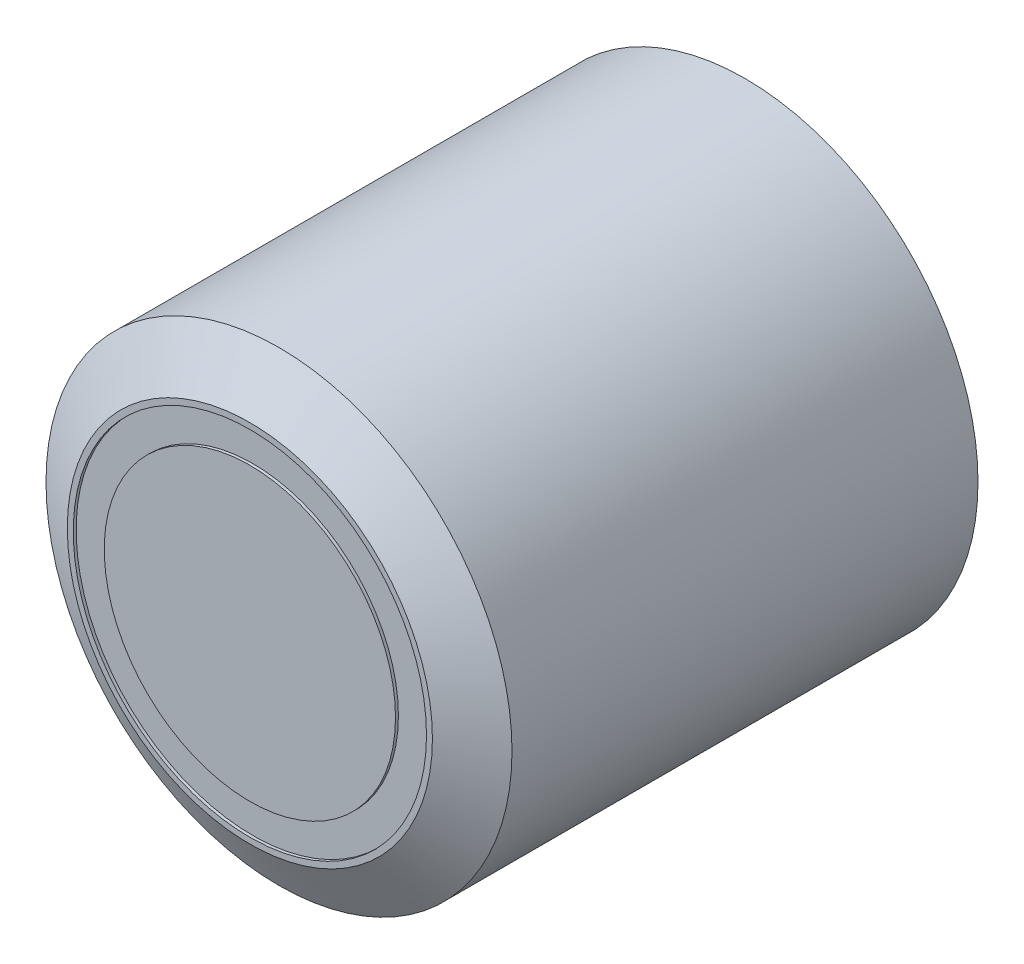
ISO-10303-21;
HEADER;
FILE_DESCRIPTION(('STEP AP214'),'2;1');
FILE_NAME('part.step','',(''),(''),'','','');
FILE_SCHEMA(('AUTOMOTIVE_DESIGN { 1 0 10303 214 1 1 1 1 }'));
ENDSEC;
DATA;
#1=APPLICATION_CONTEXT('core data for automotive mechanical design processes');
#2=APPLICATION_PROTOCOL_DEFINITION('international standard','automotive_design',2000,#1);
#3=PRODUCT_CONTEXT('',#1,'mechanical');
#4=PRODUCT('Part','Part','',(#3));
#5=PRODUCT_RELATED_PRODUCT_CATEGORY('part','',(#4));
#6=PRODUCT_DEFINITION_FORMATION('','',#4);
#7=PRODUCT_DEFINITION_CONTEXT('part definition',#1,'design');
#8=PRODUCT_DEFINITION('design','',#6,#7);
#9=PRODUCT_DEFINITION_SHAPE('','',#8);
#10=(LENGTH_UNIT() NAMED_UNIT(*) SI_UNIT(.MILLI.,.METRE.));
#11=(NAMED_UNIT(*) PLANE_ANGLE_UNIT() SI_UNIT($,.RADIAN.));
#12=(NAMED_UNIT(*) SI_UNIT($,.STERADIAN.) SOLID_ANGLE_UNIT());
#13=UNCERTAINTY_MEASURE_WITH_UNIT(LENGTH_MEASURE(1.E-05),#10,'distance_accuracy_value','');
#14=(GEOMETRIC_REPRESENTATION_CONTEXT(3) GLOBAL_UNCERTAINTY_ASSIGNED_CONTEXT((#13)) GLOBAL_UNIT_ASSIGNED_CONTEXT((#10,
#11,#12)) REPRESENTATION_CONTEXT('',''));
#15=CARTESIAN_POINT('',(0.,0.,0.));
#16=DIRECTION('',(0.,0.,1.));
#17=DIRECTION('',(1.,0.,0.));
#18=AXIS2_PLACEMENT_3D('',#15,#16,#17);
#19=CARTESIAN_POINT('',(0.,0.,16.9));
#20=DIRECTION('',(0.,0.,1.));
#21=DIRECTION('',(1.,0.,0.));
#22=AXIS2_PLACEMENT_3D('',#19,#20,#21);
#23=PLANE('',#22);
#24=CARTESIAN_POINT('',(0.,0.,16.9));
#25=DIRECTION('',(0.,0.,1.));
#26=DIRECTION('',(1.,0.,0.));
#27=AXIS2_PLACEMENT_3D('',#24,#25,#26);
#28=CIRCLE('',#27,6.06427878640835);
#29=CARTESIAN_POINT('',(6.06427878640835,0.,16.9));
#30=VERTEX_POINT('',#29);
#31=EDGE_CURVE('E48',#30,#30,#28,.T.);
#32=ORIENTED_EDGE('',*,*,#31,.T.);
#33=EDGE_LOOP('',(#32));
#34=FACE_BOUND('',#33,.T.);
#35=CARTESIAN_POINT('',(0.,0.,16.9));
#36=DIRECTION('',(0.,0.,1.));
#37=DIRECTION('',(1.,0.,0.));
#38=AXIS2_PLACEMENT_3D('',#35,#36,#37);
#39=CIRCLE('',#38,5.);
#40=CARTESIAN_POINT('',(5.,0.,16.9));
#41=VERTEX_POINT('',#40);
#42=EDGE_CURVE('E57',#41,#41,#39,.T.);
#43=ORIENTED_EDGE('',*,*,#42,.F.);
#44=EDGE_LOOP('',(#43));
#45=FACE_BOUND('',#44,.T.);
#46=ADVANCED_FACE('F33',(#34,#45),#23,.T.);
#47=CARTESIAN_POINT('',(0.,0.,17.));
#48=DIRECTION('',(0.,0.,-1.));
#49=DIRECTION('',(-1.,0.,0.));
#50=AXIS2_PLACEMENT_3D('',#47,#48,#49);
#51=CYLINDRICAL_SURFACE('',#50,8.);
#52=CARTESIAN_POINT('',(0.,0.,16.));
#53=DIRECTION('',(0.,0.,1.));
#54=DIRECTION('',(1.,0.,0.));
#55=AXIS2_PLACEMENT_3D('',#52,#53,#54);
#56=CIRCLE('',#55,8.);
#57=CARTESIAN_POINT('',(8.,0.,16.));
#58=VERTEX_POINT('',#57);
#59=EDGE_CURVE('E10',#58,#58,#56,.F.);
#60=ORIENTED_EDGE('',*,*,#59,.T.);
#61=EDGE_LOOP('',(#60));
#62=FACE_BOUND('',#61,.T.);
#63=CARTESIAN_POINT('',(0.,0.,0.));
#64=DIRECTION('',(0.,0.,1.));
#65=DIRECTION('',(1.,0.,0.));
#66=AXIS2_PLACEMENT_3D('',#63,#64,#65);
#67=CIRCLE('',#66,8.);
#68=CARTESIAN_POINT('',(8.,0.,0.));
#69=VERTEX_POINT('',#68);
#70=EDGE_CURVE('E44',#69,#69,#67,.T.);
#71=ORIENTED_EDGE('',*,*,#70,.T.);
#72=EDGE_LOOP('',(#71));
#73=FACE_BOUND('',#72,.T.);
#74=ADVANCED_FACE('F73',(#62,#73),#51,.T.);
#75=CARTESIAN_POINT('',(0.,0.,17.));
#76=DIRECTION('',(0.,0.,1.));
#77=DIRECTION('',(1.,0.,0.));
#78=AXIS2_PLACEMENT_3D('',#75,#76,#77);
#79=PLANE('',#78);
#80=CARTESIAN_POINT('',(0.,0.,17.));
#81=DIRECTION('',(0.,0.,1.));
#82=DIRECTION('',(1.,0.,0.));
#83=AXIS2_PLACEMENT_3D('',#80,#81,#82);
#84=CIRCLE('',#83,6.06427878640835);
#85=CARTESIAN_POINT('',(6.06427878640835,0.,17.));
#86=VERTEX_POINT('',#85);
#87=EDGE_CURVE('E51',#86,#86,#84,.T.);
#88=ORIENTED_EDGE('',*,*,#87,.F.);
#89=EDGE_LOOP('',(#88));
#90=FACE_BOUND('',#89,.T.);
#91=CARTESIAN_POINT('',(0.,0.,17.));
#92=DIRECTION('',(0.,0.,1.));
#93=DIRECTION('',(1.,0.,0.));
#94=AXIS2_PLACEMENT_3D('',#91,#92,#93);
#95=CIRCLE('',#94,6.26794919243113);
#96=CARTESIAN_POINT('',(6.26794919243113,0.,17.));
#97=VERTEX_POINT('',#96);
#98=EDGE_CURVE('E40',#97,#97,#95,.T.);
#99=ORIENTED_EDGE('',*,*,#98,.T.);
#100=EDGE_LOOP('',(#99));
#101=FACE_BOUND('',#100,.T.);
#102=ADVANCED_FACE('F79',(#90,#101),#79,.T.);
#103=CARTESIAN_POINT('',(0.,0.,0.));
#104=DIRECTION('',(0.,0.,1.));
#105=DIRECTION('',(1.,0.,0.));
#106=AXIS2_PLACEMENT_3D('',#103,#104,#105);
#107=PLANE('',#106);
#108=ORIENTED_EDGE('',*,*,#70,.F.);
#109=EDGE_LOOP('',(#108));
#110=FACE_BOUND('',#109,.T.);
#111=ADVANCED_FACE('F87',(#110),#107,.F.);
#112=CARTESIAN_POINT('',(0.,0.,17.));
#113=DIRECTION('',(0.,0.,-1.));
#114=DIRECTION('',(-1.,0.,0.));
#115=AXIS2_PLACEMENT_3D('',#112,#113,#114);
#116=CONICAL_SURFACE('',#115,6.26794919243113,1.0471975511966);
#117=ORIENTED_EDGE('',*,*,#59,.F.);
#118=EDGE_LOOP('',(#117));
#119=FACE_BOUND('',#118,.T.);
#120=ORIENTED_EDGE('',*,*,#98,.F.);
#121=EDGE_LOOP('',(#120));
#122=FACE_BOUND('',#121,.T.);
#123=ADVANCED_FACE('F35',(#119,#122),#116,.T.);
#124=CARTESIAN_POINT('',(0.,0.,16.9));
#125=DIRECTION('',(0.,0.,1.));
#126=DIRECTION('',(1.,0.,0.));
#127=AXIS2_PLACEMENT_3D('',#124,#125,#126);
#128=CYLINDRICAL_SURFACE('',#127,6.06427878640835);
#129=ORIENTED_EDGE('',*,*,#31,.F.);
#130=EDGE_LOOP('',(#129));
#131=FACE_BOUND('',#130,.T.);
#132=ORIENTED_EDGE('',*,*,#87,.T.);
#133=EDGE_LOOP('',(#132));
#134=FACE_BOUND('',#133,.T.);
#135=ADVANCED_FACE('F68',(#131,#134),#128,.F.);
#136=CARTESIAN_POINT('',(0.,0.,17.));
#137=DIRECTION('',(0.,0.,-1.));
#138=DIRECTION('',(-1.,0.,0.));
#139=AXIS2_PLACEMENT_3D('',#136,#137,#138);
#140=CYLINDRICAL_SURFACE('',#139,5.);
#141=CARTESIAN_POINT('',(0.,0.,17.));
#142=DIRECTION('',(0.,0.,1.));
#143=DIRECTION('',(1.,0.,0.));
#144=AXIS2_PLACEMENT_3D('',#141,#142,#143);
#145=CIRCLE('',#144,5.);
#146=CARTESIAN_POINT('',(5.,0.,17.));
#147=VERTEX_POINT('',#146);
#148=EDGE_CURVE('E54',#147,#147,#145,.T.);
#149=ORIENTED_EDGE('',*,*,#148,.F.);
#150=EDGE_LOOP('',(#149));
#151=FACE_BOUND('',#150,.T.);
#152=ORIENTED_EDGE('',*,*,#42,.T.);
#153=EDGE_LOOP('',(#152));
#154=FACE_BOUND('',#153,.T.);
#155=ADVANCED_FACE('F65',(#151,#154),#140,.T.);
#156=CARTESIAN_POINT('',(0.,0.,17.));
#157=DIRECTION('',(0.,0.,1.));
#158=DIRECTION('',(1.,0.,0.));
#159=AXIS2_PLACEMENT_3D('',#156,#157,#158);
#160=PLANE('',#159);
#161=ORIENTED_EDGE('',*,*,#148,.T.);
#162=EDGE_LOOP('',(#161));
#163=FACE_BOUND('',#162,.T.);
#164=ADVANCED_FACE('F63',(#163),#160,.T.);
#165=CLOSED_SHELL('',(#46,#74,#102,#111,#123,#135,#155,#164));
#166=MANIFOLD_SOLID_BREP('B2',#165);
#167=ADVANCED_BREP_SHAPE_REPRESENTATION('',(#18,#166),#14);
#168=SHAPE_DEFINITION_REPRESENTATION(#9,#167);
ENDSEC;
END-ISO-10303-21;
